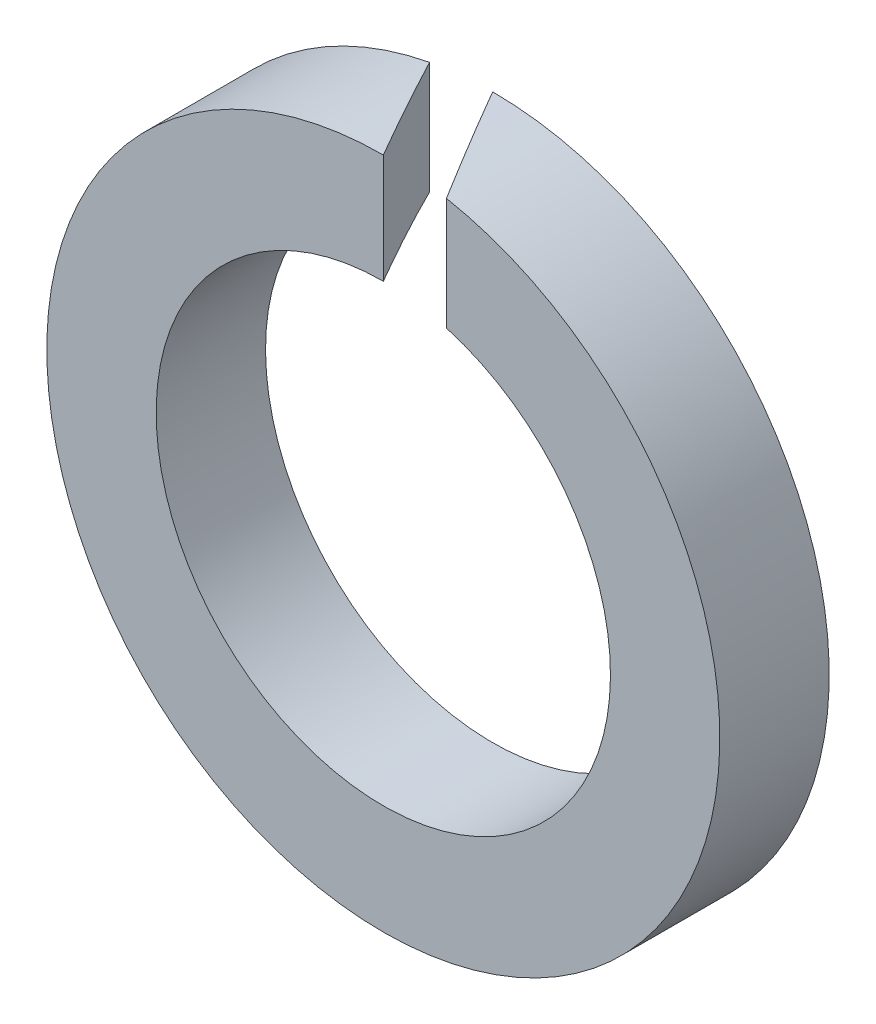
ISO-10303-21;
HEADER;
FILE_DESCRIPTION(('STEP AP214'),'2;1');
FILE_NAME('part.step','',(''),(''),'','','');
FILE_SCHEMA(('AUTOMOTIVE_DESIGN { 1 0 10303 214 1 1 1 1 }'));
ENDSEC;
DATA;
#1=APPLICATION_CONTEXT('core data for automotive mechanical design processes');
#2=APPLICATION_PROTOCOL_DEFINITION('international standard','automotive_design',2000,#1);
#3=PRODUCT_CONTEXT('',#1,'mechanical');
#4=PRODUCT('Part','Part','',(#3));
#5=PRODUCT_RELATED_PRODUCT_CATEGORY('part','',(#4));
#6=PRODUCT_DEFINITION_FORMATION('','',#4);
#7=PRODUCT_DEFINITION_CONTEXT('part definition',#1,'design');
#8=PRODUCT_DEFINITION('design','',#6,#7);
#9=PRODUCT_DEFINITION_SHAPE('','',#8);
#10=(LENGTH_UNIT() NAMED_UNIT(*) SI_UNIT(.MILLI.,.METRE.));
#11=(NAMED_UNIT(*) PLANE_ANGLE_UNIT() SI_UNIT($,.RADIAN.));
#12=(NAMED_UNIT(*) SI_UNIT($,.STERADIAN.) SOLID_ANGLE_UNIT());
#13=UNCERTAINTY_MEASURE_WITH_UNIT(LENGTH_MEASURE(1.E-05),#10,'distance_accuracy_value','');
#14=(GEOMETRIC_REPRESENTATION_CONTEXT(3) GLOBAL_UNCERTAINTY_ASSIGNED_CONTEXT((#13)) GLOBAL_UNIT_ASSIGNED_CONTEXT((#10,
#11,#12)) REPRESENTATION_CONTEXT('',''));
#15=CARTESIAN_POINT('',(0.,0.,0.));
#16=DIRECTION('',(0.,0.,1.));
#17=DIRECTION('',(1.,0.,0.));
#18=AXIS2_PLACEMENT_3D('',#15,#16,#17);
#19=CARTESIAN_POINT('',(0.,0.,-1.3));
#20=DIRECTION('',(0.,0.,1.));
#21=DIRECTION('',(1.,0.,0.));
#22=AXIS2_PLACEMENT_3D('',#19,#20,#21);
#23=CYLINDRICAL_SURFACE('',#22,4.);
#24=CARTESIAN_POINT('',(0.,0.,0.));
#25=DIRECTION('',(0.,0.,1.));
#26=DIRECTION('',(1.,0.,0.));
#27=AXIS2_PLACEMENT_3D('',#24,#25,#26);
#28=CIRCLE('',#27,4.);
#29=CARTESIAN_POINT('',(0.,4.,0.));
#30=VERTEX_POINT('',#29);
#31=CARTESIAN_POINT('',(0.750555349946513,3.92895236248375,0.));
#32=VERTEX_POINT('',#31);
#33=EDGE_CURVE('E85',#30,#32,#28,.T.);
#34=ORIENTED_EDGE('',*,*,#33,.F.);
#35=CARTESIAN_POINT('',(0.,0.,0.));
#36=DIRECTION('',(0.866025403784439,0.,-0.5));
#37=DIRECTION('',(0.5,0.,0.866025403784439));
#38=AXIS2_PLACEMENT_3D('',#35,#36,#37);
#39=ELLIPSE('',#38,8.00000000000001,4.);
#40=CARTESIAN_POINT('',(-0.750555349946513,3.92895236248375,-1.3));
#41=VERTEX_POINT('',#40);
#42=EDGE_CURVE('E69',#30,#41,#39,.F.);
#43=ORIENTED_EDGE('',*,*,#42,.T.);
#44=CARTESIAN_POINT('',(0.,0.,-1.3));
#45=DIRECTION('',(0.,0.,1.));
#46=DIRECTION('',(1.,0.,0.));
#47=AXIS2_PLACEMENT_3D('',#44,#45,#46);
#48=CIRCLE('',#47,4.);
#49=CARTESIAN_POINT('',(0.,4.,-1.3));
#50=VERTEX_POINT('',#49);
#51=EDGE_CURVE('E90',#41,#50,#48,.T.);
#52=ORIENTED_EDGE('',*,*,#51,.T.);
#53=CARTESIAN_POINT('',(0.,0.,-1.3));
#54=DIRECTION('',(-0.866025403784439,0.,0.5));
#55=DIRECTION('',(0.5,0.,0.866025403784439));
#56=AXIS2_PLACEMENT_3D('',#53,#54,#55);
#57=ELLIPSE('',#56,8.00000000000001,4.);
#58=EDGE_CURVE('E78',#50,#32,#57,.F.);
#59=ORIENTED_EDGE('',*,*,#58,.T.);
#60=EDGE_LOOP('',(#34,#43,#52,#59));
#61=FACE_BOUND('',#60,.T.);
#62=ADVANCED_FACE('F32',(#61),#23,.T.);
#63=CARTESIAN_POINT('',(0.,0.,-1.3));
#64=DIRECTION('',(0.,0.,1.));
#65=DIRECTION('',(1.,0.,0.));
#66=AXIS2_PLACEMENT_3D('',#63,#64,#65);
#67=PLANE('',#66);
#68=DIRECTION('',(0.,-1.,0.));
#69=VECTOR('',#68,1.);
#70=CARTESIAN_POINT('',(-0.750555349946513,4.,-1.3));
#71=LINE('',#70,#69);
#72=CARTESIAN_POINT('',(-0.750555349946513,2.59358182185692,-1.3));
#73=VERTEX_POINT('',#72);
#74=EDGE_CURVE('E72',#41,#73,#71,.T.);
#75=ORIENTED_EDGE('',*,*,#74,.T.);
#76=CARTESIAN_POINT('',(0.,0.,-1.3));
#77=DIRECTION('',(0.,0.,1.));
#78=DIRECTION('',(1.,0.,0.));
#79=AXIS2_PLACEMENT_3D('',#76,#77,#78);
#80=CIRCLE('',#79,2.7);
#81=CARTESIAN_POINT('',(0.,2.7,-1.3));
#82=VERTEX_POINT('',#81);
#83=EDGE_CURVE('E91',#73,#82,#80,.T.);
#84=ORIENTED_EDGE('',*,*,#83,.T.);
#85=DIRECTION('',(0.,-1.,0.));
#86=VECTOR('',#85,1.);
#87=CARTESIAN_POINT('',(0.,4.,-1.3));
#88=LINE('',#87,#86);
#89=EDGE_CURVE('E53',#50,#82,#88,.T.);
#90=ORIENTED_EDGE('',*,*,#89,.F.);
#91=ORIENTED_EDGE('',*,*,#51,.F.);
#92=EDGE_LOOP('',(#75,#84,#90,#91));
#93=FACE_BOUND('',#92,.T.);
#94=ADVANCED_FACE('F106',(#93),#67,.F.);
#95=CARTESIAN_POINT('',(0.,0.,0.));
#96=DIRECTION('',(0.,0.,1.));
#97=DIRECTION('',(1.,0.,0.));
#98=AXIS2_PLACEMENT_3D('',#95,#96,#97);
#99=PLANE('',#98);
#100=CARTESIAN_POINT('',(0.,0.,0.));
#101=DIRECTION('',(0.,0.,1.));
#102=DIRECTION('',(1.,0.,0.));
#103=AXIS2_PLACEMENT_3D('',#100,#101,#102);
#104=CIRCLE('',#103,2.7);
#105=CARTESIAN_POINT('',(0.,2.7,0.));
#106=VERTEX_POINT('',#105);
#107=CARTESIAN_POINT('',(0.750555349946513,2.59358182185692,0.));
#108=VERTEX_POINT('',#107);
#109=EDGE_CURVE('E77',#106,#108,#104,.T.);
#110=ORIENTED_EDGE('',*,*,#109,.F.);
#111=DIRECTION('',(0.,-1.,0.));
#112=VECTOR('',#111,1.);
#113=CARTESIAN_POINT('',(0.,4.,0.));
#114=LINE('',#113,#112);
#115=EDGE_CURVE('E45',#30,#106,#114,.T.);
#116=ORIENTED_EDGE('',*,*,#115,.F.);
#117=ORIENTED_EDGE('',*,*,#33,.T.);
#118=DIRECTION('',(0.,-1.,0.));
#119=VECTOR('',#118,1.);
#120=CARTESIAN_POINT('',(0.750555349946513,4.,0.));
#121=LINE('',#120,#119);
#122=EDGE_CURVE('E87',#32,#108,#121,.T.);
#123=ORIENTED_EDGE('',*,*,#122,.T.);
#124=EDGE_LOOP('',(#110,#116,#117,#123));
#125=FACE_BOUND('',#124,.T.);
#126=ADVANCED_FACE('F83',(#125),#99,.T.);
#127=CARTESIAN_POINT('',(0.,0.,-1.3));
#128=DIRECTION('',(0.,0.,1.));
#129=DIRECTION('',(1.,0.,0.));
#130=AXIS2_PLACEMENT_3D('',#127,#128,#129);
#131=CYLINDRICAL_SURFACE('',#130,2.7);
#132=CARTESIAN_POINT('',(0.,0.,0.));
#133=DIRECTION('',(0.866025403784439,0.,-0.5));
#134=DIRECTION('',(0.5,0.,0.866025403784439));
#135=AXIS2_PLACEMENT_3D('',#132,#133,#134);
#136=ELLIPSE('',#135,5.4,2.7);
#137=EDGE_CURVE('E11',#106,#73,#136,.F.);
#138=ORIENTED_EDGE('',*,*,#137,.F.);
#139=ORIENTED_EDGE('',*,*,#109,.T.);
#140=CARTESIAN_POINT('',(0.,0.,-1.3));
#141=DIRECTION('',(-0.866025403784439,0.,0.5));
#142=DIRECTION('',(0.5,0.,0.866025403784439));
#143=AXIS2_PLACEMENT_3D('',#140,#141,#142);
#144=ELLIPSE('',#143,5.4,2.7);
#145=EDGE_CURVE('E39',#82,#108,#144,.F.);
#146=ORIENTED_EDGE('',*,*,#145,.F.);
#147=ORIENTED_EDGE('',*,*,#83,.F.);
#148=EDGE_LOOP('',(#138,#139,#146,#147));
#149=FACE_BOUND('',#148,.T.);
#150=ADVANCED_FACE('F101',(#149),#131,.F.);
#151=CARTESIAN_POINT('',(0.,4.,-1.3));
#152=DIRECTION('',(-0.866025403784439,0.,0.5));
#153=DIRECTION('',(0.5,0.,0.866025403784439));
#154=AXIS2_PLACEMENT_3D('',#151,#152,#153);
#155=PLANE('',#154);
#156=ORIENTED_EDGE('',*,*,#89,.T.);
#157=ORIENTED_EDGE('',*,*,#145,.T.);
#158=ORIENTED_EDGE('',*,*,#122,.F.);
#159=ORIENTED_EDGE('',*,*,#58,.F.);
#160=EDGE_LOOP('',(#156,#157,#158,#159));
#161=FACE_BOUND('',#160,.T.);
#162=ADVANCED_FACE('F97',(#161),#155,.T.);
#163=CARTESIAN_POINT('',(0.,4.,0.));
#164=DIRECTION('',(0.866025403784439,0.,-0.5));
#165=DIRECTION('',(-0.5,0.,-0.866025403784439));
#166=AXIS2_PLACEMENT_3D('',#163,#164,#165);
#167=PLANE('',#166);
#168=ORIENTED_EDGE('',*,*,#115,.T.);
#169=ORIENTED_EDGE('',*,*,#137,.T.);
#170=ORIENTED_EDGE('',*,*,#74,.F.);
#171=ORIENTED_EDGE('',*,*,#42,.F.);
#172=EDGE_LOOP('',(#168,#169,#170,#171));
#173=FACE_BOUND('',#172,.T.);
#174=ADVANCED_FACE('F70',(#173),#167,.T.);
#175=CLOSED_SHELL('',(#62,#94,#126,#150,#162,#174));
#176=MANIFOLD_SOLID_BREP('B2',#175);
#177=ADVANCED_BREP_SHAPE_REPRESENTATION('',(#18,#176),#14);
#178=SHAPE_DEFINITION_REPRESENTATION(#9,#177);
ENDSEC;
END-ISO-10303-21;
